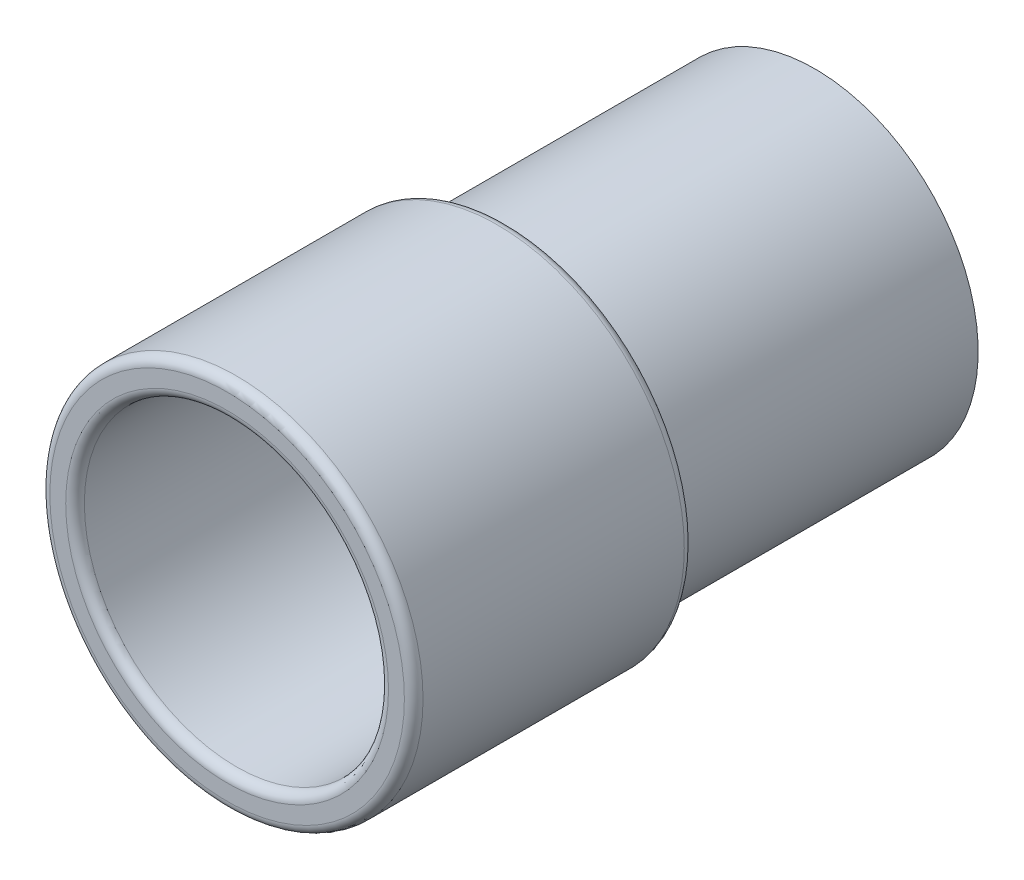
ISO-10303-21;
HEADER;
FILE_DESCRIPTION(('STEP AP214'),'2;1');
FILE_NAME('part.step','',(''),(''),'','','');
FILE_SCHEMA(('AUTOMOTIVE_DESIGN { 1 0 10303 214 1 1 1 1 }'));
ENDSEC;
DATA;
#1=APPLICATION_CONTEXT('core data for automotive mechanical design processes');
#2=APPLICATION_PROTOCOL_DEFINITION('international standard','automotive_design',2000,#1);
#3=PRODUCT_CONTEXT('',#1,'mechanical');
#4=PRODUCT('Part','Part','',(#3));
#5=PRODUCT_RELATED_PRODUCT_CATEGORY('part','',(#4));
#6=PRODUCT_DEFINITION_FORMATION('','',#4);
#7=PRODUCT_DEFINITION_CONTEXT('part definition',#1,'design');
#8=PRODUCT_DEFINITION('design','',#6,#7);
#9=PRODUCT_DEFINITION_SHAPE('','',#8);
#10=(LENGTH_UNIT() NAMED_UNIT(*) SI_UNIT(.MILLI.,.METRE.));
#11=(NAMED_UNIT(*) PLANE_ANGLE_UNIT() SI_UNIT($,.RADIAN.));
#12=(NAMED_UNIT(*) SI_UNIT($,.STERADIAN.) SOLID_ANGLE_UNIT());
#13=UNCERTAINTY_MEASURE_WITH_UNIT(LENGTH_MEASURE(1.E-05),#10,'distance_accuracy_value','');
#14=(GEOMETRIC_REPRESENTATION_CONTEXT(3) GLOBAL_UNCERTAINTY_ASSIGNED_CONTEXT((#13)) GLOBAL_UNIT_ASSIGNED_CONTEXT((#10,
#11,#12)) REPRESENTATION_CONTEXT('',''));
#15=CARTESIAN_POINT('',(0.,0.,0.));
#16=DIRECTION('',(0.,0.,1.));
#17=DIRECTION('',(1.,0.,0.));
#18=AXIS2_PLACEMENT_3D('',#15,#16,#17);
#19=CARTESIAN_POINT('',(0.,0.,0.));
#20=DIRECTION('',(0.,0.,-1.));
#21=DIRECTION('',(-1.,0.,0.));
#22=AXIS2_PLACEMENT_3D('',#19,#20,#21);
#23=PLANE('',#22);
#24=CARTESIAN_POINT('',(0.,0.,0.));
#25=DIRECTION('',(0.,0.,-1.));
#26=DIRECTION('',(-1.,0.,0.));
#27=AXIS2_PLACEMENT_3D('',#24,#25,#26);
#28=CIRCLE('',#27,14.);
#29=CARTESIAN_POINT('',(-14.,0.,0.));
#30=VERTEX_POINT('',#29);
#31=EDGE_CURVE('E298',#30,#30,#28,.F.);
#32=ORIENTED_EDGE('',*,*,#31,.T.);
#33=EDGE_LOOP('',(#32));
#34=FACE_BOUND('',#33,.T.);
#35=CARTESIAN_POINT('',(0.,0.,0.));
#36=DIRECTION('',(0.,0.,-1.));
#37=DIRECTION('',(-1.,0.,0.));
#38=AXIS2_PLACEMENT_3D('',#35,#36,#37);
#39=CIRCLE('',#38,3.5);
#40=CARTESIAN_POINT('',(-3.5,0.,0.));
#41=VERTEX_POINT('',#40);
#42=EDGE_CURVE('E654',#41,#41,#39,.T.);
#43=ORIENTED_EDGE('',*,*,#42,.T.);
#44=EDGE_LOOP('',(#43));
#45=FACE_BOUND('',#44,.T.);
#46=DIRECTION('',(-0.487280608017738,-0.873245446051603,0.));
#47=VECTOR('',#46,1.);
#48=CARTESIAN_POINT('',(2.32712401680226,-1.29856091545318,0.));
#49=LINE('',#48,#47);
#50=CARTESIAN_POINT('',(-1.57112084733964,-8.284524483866,0.));
#51=VERTEX_POINT('',#50);
#52=CARTESIAN_POINT('',(-2.6971996148729,-10.3025468296434,0.));
#53=VERTEX_POINT('',#52);
#54=EDGE_CURVE('E205',#51,#53,#49,.T.);
#55=ORIENTED_EDGE('',*,*,#54,.T.);
#56=CARTESIAN_POINT('',(-3.1338223378987,-10.0589065256346,0.));
#57=DIRECTION('',(0.,0.,-1.));
#58=DIRECTION('',(-1.,0.,0.));
#59=AXIS2_PLACEMENT_3D('',#56,#57,#58);
#60=CIRCLE('',#59,0.5);
#61=CARTESIAN_POINT('',(-3.37746264190757,-10.4955292486604,0.));
#62=VERTEX_POINT('',#61);
#63=EDGE_CURVE('E267',#53,#62,#60,.T.);
#64=ORIENTED_EDGE('',*,*,#63,.T.);
#65=DIRECTION('',(-0.873245446051604,0.487280608017737,0.));
#66=VECTOR('',#65,1.);
#67=CARTESIAN_POINT('',(-5.26796393568401,-9.44060863721608,0.));
#68=LINE('',#67,#66);
#69=CARTESIAN_POINT('',(-7.15846522946052,-8.38568802577175,0.));
#70=VERTEX_POINT('',#69);
#71=EDGE_CURVE('E208',#62,#70,#68,.T.);
#72=ORIENTED_EDGE('',*,*,#71,.T.);
#73=CARTESIAN_POINT('',(-6.91482492545165,-7.94906530274595,0.));
#74=DIRECTION('',(0.,0.,-1.));
#75=DIRECTION('',(-1.,0.,0.));
#76=AXIS2_PLACEMENT_3D('',#73,#74,#75);
#77=CIRCLE('',#76,0.5);
#78=CARTESIAN_POINT('',(-7.35144764847745,-7.70542499873708,0.));
#79=VERTEX_POINT('',#78);
#80=EDGE_CURVE('E259',#70,#79,#77,.T.);
#81=ORIENTED_EDGE('',*,*,#80,.T.);
#82=DIRECTION('',(0.487280608017738,0.873245446051603,0.));
#83=VECTOR('',#82,1.);
#84=CARTESIAN_POINT('',(-2.3271240168023,1.29856091545319,0.));
#85=LINE('',#84,#83);
#86=CARTESIAN_POINT('',(-6.2253688809442,-5.68740265295964,0.));
#87=VERTEX_POINT('',#86);
#88=EDGE_CURVE('E211',#79,#87,#85,.T.);
#89=ORIENTED_EDGE('',*,*,#88,.T.);
#90=CARTESIAN_POINT('',(-5.7887461579184,-5.93104295696851,0.));
#91=DIRECTION('',(0.,0.,-1.));
#92=DIRECTION('',(-1.,0.,0.));
#93=AXIS2_PLACEMENT_3D('',#90,#91,#92);
#94=CIRCLE('',#93,0.5);
#95=CARTESIAN_POINT('',(-5.54510585390953,-5.4944202339427,0.));
#96=VERTEX_POINT('',#95);
#97=EDGE_CURVE('E263',#87,#96,#94,.T.);
#98=ORIENTED_EDGE('',*,*,#97,.T.);
#99=DIRECTION('',(0.873245446051604,-0.487280608017737,0.));
#100=VECTOR('',#99,1.);
#101=CARTESIAN_POINT('',(-3.65460456013303,-6.54934084538703,0.));
#102=LINE('',#101,#100);
#103=CARTESIAN_POINT('',(-1.76410326635658,-7.60426145683133,0.));
#104=VERTEX_POINT('',#103);
#105=EDGE_CURVE('E202',#96,#104,#102,.T.);
#106=ORIENTED_EDGE('',*,*,#105,.T.);
#107=CARTESIAN_POINT('',(-2.00774357036545,-8.04088417985713,0.));
#108=DIRECTION('',(0.,0.,-1.));
#109=DIRECTION('',(-1.,0.,0.));
#110=AXIS2_PLACEMENT_3D('',#107,#108,#109);
#111=CIRCLE('',#110,0.5);
#112=EDGE_CURVE('E271',#104,#51,#111,.T.);
#113=ORIENTED_EDGE('',*,*,#112,.T.);
#114=EDGE_LOOP('',(#55,#64,#72,#81,#89,#98,#106,#113));
#115=FACE_BOUND('',#114,.T.);
#116=DIRECTION('',(-0.48728060801761,-0.873245446051675,0.));
#117=VECTOR('',#116,1.);
#118=CARTESIAN_POINT('',(-2.32712401680149,1.2985609154523,0.));
#119=LINE('',#118,#117);
#120=CARTESIAN_POINT('',(2.6971996148725,10.3025468296436,0.));
#121=VERTEX_POINT('',#120);
#122=CARTESIAN_POINT('',(1.56867938704217,8.28014919363008,0.));
#123=VERTEX_POINT('',#122);
#124=EDGE_CURVE('E199',#121,#123,#119,.T.);
#125=ORIENTED_EDGE('',*,*,#124,.F.);
#126=CARTESIAN_POINT('',(3.13382233789834,10.0589065256348,0.));
#127=DIRECTION('',(0.,0.,-1.));
#128=DIRECTION('',(-1.,0.,0.));
#129=AXIS2_PLACEMENT_3D('',#126,#127,#128);
#130=CIRCLE('',#129,0.5);
#131=CARTESIAN_POINT('',(3.37746264190721,10.4955292486606,0.));
#132=VERTEX_POINT('',#131);
#133=EDGE_CURVE('E278',#121,#132,#130,.T.);
#134=ORIENTED_EDGE('',*,*,#133,.T.);
#135=DIRECTION('',(-0.873245446051604,0.487280608017737,0.));
#136=VECTOR('',#135,1.);
#137=CARTESIAN_POINT('',(5.26796393568402,9.44060863721608,0.));
#138=LINE('',#137,#136);
#139=CARTESIAN_POINT('',(7.15846522946053,8.38568802577174,0.));
#140=VERTEX_POINT('',#139);
#141=EDGE_CURVE('E189',#140,#132,#138,.T.);
#142=ORIENTED_EDGE('',*,*,#141,.F.);
#143=CARTESIAN_POINT('',(6.91482492545166,7.94906530274594,0.));
#144=DIRECTION('',(0.,0.,-1.));
#145=DIRECTION('',(-1.,0.,0.));
#146=AXIS2_PLACEMENT_3D('',#143,#144,#145);
#147=CIRCLE('',#146,0.5);
#148=CARTESIAN_POINT('',(7.35144764847746,7.70542499873707,0.));
#149=VERTEX_POINT('',#148);
#150=EDGE_CURVE('E284',#140,#149,#147,.T.);
#151=ORIENTED_EDGE('',*,*,#150,.T.);
#152=DIRECTION('',(0.487280608017739,0.873245446051603,0.));
#153=VECTOR('',#152,1.);
#154=CARTESIAN_POINT('',(2.3271240168023,-1.2985609154532,0.));
#155=LINE('',#154,#153);
#156=CARTESIAN_POINT('',(6.22536888094421,5.68740265295963,0.));
#157=VERTEX_POINT('',#156);
#158=EDGE_CURVE('E192',#157,#149,#155,.T.);
#159=ORIENTED_EDGE('',*,*,#158,.F.);
#160=CARTESIAN_POINT('',(5.7887461579184,5.9310429569685,0.));
#161=DIRECTION('',(0.,0.,-1.));
#162=DIRECTION('',(-1.,0.,0.));
#163=AXIS2_PLACEMENT_3D('',#160,#161,#162);
#164=CIRCLE('',#163,0.5);
#165=CARTESIAN_POINT('',(5.54510585390953,5.4944202339427,0.));
#166=VERTEX_POINT('',#165);
#167=EDGE_CURVE('E281',#157,#166,#164,.T.);
#168=ORIENTED_EDGE('',*,*,#167,.T.);
#169=DIRECTION('',(0.873245446051603,-0.487280608017738,0.));
#170=VECTOR('',#169,1.);
#171=CARTESIAN_POINT('',(3.65460456013303,6.54934084538703,0.));
#172=LINE('',#171,#170);
#173=CARTESIAN_POINT('',(3.65460456013308,6.549340845387,0.));
#174=VERTEX_POINT('',#173);
#175=EDGE_CURVE('E196',#174,#166,#172,.T.);
#176=ORIENTED_EDGE('',*,*,#175,.F.);
#177=DIRECTION('',(-0.874371144773339,0.485257767776839,0.));
#178=VECTOR('',#177,1.);
#179=CARTESIAN_POINT('',(3.63942350631884,6.55776601395578,0.));
#180=LINE('',#179,#178);
#181=CARTESIAN_POINT('',(1.76267322617958,7.5993233172346,0.));
#182=VERTEX_POINT('',#181);
#183=EDGE_CURVE('E170',#174,#182,#180,.T.);
#184=ORIENTED_EDGE('',*,*,#183,.T.);
#185=CARTESIAN_POINT('',(2.005302110068,8.03650888962127,0.));
#186=DIRECTION('',(0.,0.,-1.));
#187=DIRECTION('',(-1.,0.,0.));
#188=AXIS2_PLACEMENT_3D('',#185,#186,#187);
#189=CIRCLE('',#188,0.5);
#190=EDGE_CURVE('E274',#182,#123,#189,.T.);
#191=ORIENTED_EDGE('',*,*,#190,.T.);
#192=EDGE_LOOP('',(#125,#134,#142,#151,#159,#168,#176,#184,#191));
#193=FACE_BOUND('',#192,.T.);
#194=ADVANCED_FACE('F42',(#34,#45,#115,#193),#23,.F.);
#195=CARTESIAN_POINT('',(0.,0.,-3.));
#196=DIRECTION('',(0.,0.,-1.));
#197=DIRECTION('',(-1.,0.,0.));
#198=AXIS2_PLACEMENT_3D('',#195,#196,#197);
#199=PLANE('',#198);
#200=CARTESIAN_POINT('',(0.,0.,-3.));
#201=DIRECTION('',(0.,0.,-1.));
#202=DIRECTION('',(-1.,0.,0.));
#203=AXIS2_PLACEMENT_3D('',#200,#201,#202);
#204=CIRCLE('',#203,3.5);
#205=CARTESIAN_POINT('',(-3.5,0.,-3.));
#206=VERTEX_POINT('',#205);
#207=EDGE_CURVE('E651',#206,#206,#204,.T.);
#208=ORIENTED_EDGE('',*,*,#207,.F.);
#209=EDGE_LOOP('',(#208));
#210=FACE_BOUND('',#209,.T.);
#211=DIRECTION('',(0.487280608017738,0.873245446051603,0.));
#212=VECTOR('',#211,1.);
#213=CARTESIAN_POINT('',(-2.3271240168023,1.29856091545319,-3.));
#214=LINE('',#213,#212);
#215=CARTESIAN_POINT('',(-7.35144764847745,-7.70542499873708,-3.));
#216=VERTEX_POINT('',#215);
#217=CARTESIAN_POINT('',(-6.2253688809442,-5.68740265295964,-3.));
#218=VERTEX_POINT('',#217);
#219=EDGE_CURVE('E174',#216,#218,#214,.T.);
#220=ORIENTED_EDGE('',*,*,#219,.F.);
#221=CARTESIAN_POINT('',(-6.91482492545165,-7.94906530274595,-3.));
#222=DIRECTION('',(0.,0.,-1.));
#223=DIRECTION('',(-1.,0.,0.));
#224=AXIS2_PLACEMENT_3D('',#221,#222,#223);
#225=CIRCLE('',#224,0.5);
#226=CARTESIAN_POINT('',(-7.15846522946052,-8.38568802577176,-3.));
#227=VERTEX_POINT('',#226);
#228=EDGE_CURVE('E257',#216,#227,#225,.F.);
#229=ORIENTED_EDGE('',*,*,#228,.T.);
#230=DIRECTION('',(-0.873245446051604,0.487280608017737,0.));
#231=VECTOR('',#230,1.);
#232=CARTESIAN_POINT('',(-5.26796393568401,-9.44060863721609,-3.));
#233=LINE('',#232,#231);
#234=CARTESIAN_POINT('',(-3.37746264190757,-10.4955292486604,-3.));
#235=VERTEX_POINT('',#234);
#236=EDGE_CURVE('E193',#235,#227,#233,.T.);
#237=ORIENTED_EDGE('',*,*,#236,.F.);
#238=CARTESIAN_POINT('',(-3.1338223378987,-10.0589065256346,-3.));
#239=DIRECTION('',(0.,0.,-1.));
#240=DIRECTION('',(-1.,0.,0.));
#241=AXIS2_PLACEMENT_3D('',#238,#239,#240);
#242=CIRCLE('',#241,0.5);
#243=CARTESIAN_POINT('',(-2.6971996148729,-10.3025468296434,-3.));
#244=VERTEX_POINT('',#243);
#245=EDGE_CURVE('E265',#235,#244,#242,.F.);
#246=ORIENTED_EDGE('',*,*,#245,.T.);
#247=DIRECTION('',(-0.487280608017738,-0.873245446051603,0.));
#248=VECTOR('',#247,1.);
#249=CARTESIAN_POINT('',(2.32712401680226,-1.29856091545317,-3.));
#250=LINE('',#249,#248);
#251=CARTESIAN_POINT('',(-1.57112084733964,-8.284524483866,-3.));
#252=VERTEX_POINT('',#251);
#253=EDGE_CURVE('E666',#252,#244,#250,.T.);
#254=ORIENTED_EDGE('',*,*,#253,.F.);
#255=CARTESIAN_POINT('',(-2.00774357036545,-8.04088417985713,-3.));
#256=DIRECTION('',(0.,0.,-1.));
#257=DIRECTION('',(-1.,0.,0.));
#258=AXIS2_PLACEMENT_3D('',#255,#256,#257);
#259=CIRCLE('',#258,0.5);
#260=CARTESIAN_POINT('',(-1.76410326635658,-7.60426145683133,-3.));
#261=VERTEX_POINT('',#260);
#262=EDGE_CURVE('E269',#252,#261,#259,.F.);
#263=ORIENTED_EDGE('',*,*,#262,.T.);
#264=DIRECTION('',(0.873245446051604,-0.487280608017737,0.));
#265=VECTOR('',#264,1.);
#266=CARTESIAN_POINT('',(-3.65460456013303,-6.54934084538703,-3.));
#267=LINE('',#266,#265);
#268=CARTESIAN_POINT('',(-5.54510585390953,-5.4944202339427,-3.));
#269=VERTEX_POINT('',#268);
#270=EDGE_CURVE('E663',#269,#261,#267,.T.);
#271=ORIENTED_EDGE('',*,*,#270,.F.);
#272=CARTESIAN_POINT('',(-5.7887461579184,-5.93104295696851,-3.));
#273=DIRECTION('',(0.,0.,-1.));
#274=DIRECTION('',(-1.,0.,0.));
#275=AXIS2_PLACEMENT_3D('',#272,#273,#274);
#276=CIRCLE('',#275,0.5);
#277=EDGE_CURVE('E261',#269,#218,#276,.F.);
#278=ORIENTED_EDGE('',*,*,#277,.T.);
#279=EDGE_LOOP('',(#220,#229,#237,#246,#254,#263,#271,#278));
#280=FACE_BOUND('',#279,.T.);
#281=CARTESIAN_POINT('',(0.,0.,-3.));
#282=DIRECTION('',(0.,0.,-1.));
#283=DIRECTION('',(-1.,0.,0.));
#284=AXIS2_PLACEMENT_3D('',#281,#282,#283);
#285=CIRCLE('',#284,17.5);
#286=CARTESIAN_POINT('',(-17.5,0.,-3.));
#287=VERTEX_POINT('',#286);
#288=EDGE_CURVE('E214',#287,#287,#285,.T.);
#289=ORIENTED_EDGE('',*,*,#288,.T.);
#290=EDGE_LOOP('',(#289));
#291=FACE_BOUND('',#290,.T.);
#292=DIRECTION('',(0.487280608017739,0.873245446051603,0.));
#293=VECTOR('',#292,1.);
#294=CARTESIAN_POINT('',(2.3271240168023,-1.2985609154532,-3.));
#295=LINE('',#294,#293);
#296=CARTESIAN_POINT('',(6.22536888094421,5.68740265295963,-3.));
#297=VERTEX_POINT('',#296);
#298=CARTESIAN_POINT('',(7.35144764847746,7.70542499873707,-3.));
#299=VERTEX_POINT('',#298);
#300=EDGE_CURVE('E181',#297,#299,#295,.T.);
#301=ORIENTED_EDGE('',*,*,#300,.T.);
#302=CARTESIAN_POINT('',(6.91482492545166,7.94906530274594,-3.));
#303=DIRECTION('',(0.,0.,-1.));
#304=DIRECTION('',(-1.,0.,0.));
#305=AXIS2_PLACEMENT_3D('',#302,#303,#304);
#306=CIRCLE('',#305,0.5);
#307=CARTESIAN_POINT('',(7.15846522946053,8.38568802577174,-3.));
#308=VERTEX_POINT('',#307);
#309=EDGE_CURVE('E57',#299,#308,#306,.F.);
#310=ORIENTED_EDGE('',*,*,#309,.T.);
#311=DIRECTION('',(-0.873245446051604,0.487280608017737,0.));
#312=VECTOR('',#311,1.);
#313=CARTESIAN_POINT('',(5.26796393568402,9.44060863721608,-3.));
#314=LINE('',#313,#312);
#315=CARTESIAN_POINT('',(3.37746264190721,10.4955292486606,-3.));
#316=VERTEX_POINT('',#315);
#317=EDGE_CURVE('E657',#308,#316,#314,.T.);
#318=ORIENTED_EDGE('',*,*,#317,.T.);
#319=CARTESIAN_POINT('',(3.13382233789834,10.0589065256348,-3.));
#320=DIRECTION('',(0.,0.,-1.));
#321=DIRECTION('',(-1.,0.,0.));
#322=AXIS2_PLACEMENT_3D('',#319,#320,#321);
#323=CIRCLE('',#322,0.5);
#324=CARTESIAN_POINT('',(2.6971996148725,10.3025468296436,-3.));
#325=VERTEX_POINT('',#324);
#326=EDGE_CURVE('E276',#316,#325,#323,.F.);
#327=ORIENTED_EDGE('',*,*,#326,.T.);
#328=DIRECTION('',(-0.48728060801761,-0.873245446051675,0.));
#329=VECTOR('',#328,1.);
#330=CARTESIAN_POINT('',(-2.32712401680149,1.2985609154523,-3.));
#331=LINE('',#330,#329);
#332=CARTESIAN_POINT('',(1.56867938704217,8.28014919363008,-3.));
#333=VERTEX_POINT('',#332);
#334=EDGE_CURVE('E655',#325,#333,#331,.T.);
#335=ORIENTED_EDGE('',*,*,#334,.T.);
#336=CARTESIAN_POINT('',(2.005302110068,8.03650888962127,-3.));
#337=DIRECTION('',(0.,0.,-1.));
#338=DIRECTION('',(-1.,0.,0.));
#339=AXIS2_PLACEMENT_3D('',#336,#337,#338);
#340=CIRCLE('',#339,0.5);
#341=CARTESIAN_POINT('',(1.76267322617958,7.5993233172346,-3.));
#342=VERTEX_POINT('',#341);
#343=EDGE_CURVE('E185',#333,#342,#340,.F.);
#344=ORIENTED_EDGE('',*,*,#343,.T.);
#345=DIRECTION('',(-0.874371144773339,0.485257767776839,0.));
#346=VECTOR('',#345,1.);
#347=CARTESIAN_POINT('',(3.63942350631884,6.55776601395578,-3.));
#348=LINE('',#347,#346);
#349=CARTESIAN_POINT('',(3.65460456013308,6.549340845387,-3.));
#350=VERTEX_POINT('',#349);
#351=EDGE_CURVE('E167',#350,#342,#348,.T.);
#352=ORIENTED_EDGE('',*,*,#351,.F.);
#353=DIRECTION('',(0.873245446051603,-0.487280608017738,0.));
#354=VECTOR('',#353,1.);
#355=CARTESIAN_POINT('',(3.65460456013303,6.54934084538702,-3.));
#356=LINE('',#355,#354);
#357=CARTESIAN_POINT('',(5.54510585390953,5.4944202339427,-3.));
#358=VERTEX_POINT('',#357);
#359=EDGE_CURVE('E177',#350,#358,#356,.T.);
#360=ORIENTED_EDGE('',*,*,#359,.T.);
#361=CARTESIAN_POINT('',(5.7887461579184,5.9310429569685,-3.));
#362=DIRECTION('',(0.,0.,-1.));
#363=DIRECTION('',(-1.,0.,0.));
#364=AXIS2_PLACEMENT_3D('',#361,#362,#363);
#365=CIRCLE('',#364,0.5);
#366=EDGE_CURVE('E65',#358,#297,#365,.F.);
#367=ORIENTED_EDGE('',*,*,#366,.T.);
#368=EDGE_LOOP('',(#301,#310,#318,#327,#335,#344,#352,#360,#367));
#369=FACE_BOUND('',#368,.T.);
#370=ADVANCED_FACE('F183',(#210,#280,#291,#369),#199,.T.);
#371=CARTESIAN_POINT('',(0.,0.,30.));
#372=DIRECTION('',(0.,0.,-1.));
#373=DIRECTION('',(-1.,0.,0.));
#374=AXIS2_PLACEMENT_3D('',#371,#372,#373);
#375=CYLINDRICAL_SURFACE('',#374,17.5);
#376=CARTESIAN_POINT('',(0.,0.,30.));
#377=DIRECTION('',(0.,0.,1.));
#378=DIRECTION('',(1.,0.,0.));
#379=AXIS2_PLACEMENT_3D('',#376,#377,#378);
#380=CIRCLE('',#379,17.5);
#381=CARTESIAN_POINT('',(17.5,0.,30.));
#382=VERTEX_POINT('',#381);
#383=EDGE_CURVE('E217',#382,#382,#380,.T.);
#384=ORIENTED_EDGE('',*,*,#383,.F.);
#385=EDGE_LOOP('',(#384));
#386=FACE_BOUND('',#385,.T.);
#387=ORIENTED_EDGE('',*,*,#288,.F.);
#388=EDGE_LOOP('',(#387));
#389=FACE_BOUND('',#388,.T.);
#390=ADVANCED_FACE('F333',(#386,#389),#375,.T.);
#391=CARTESIAN_POINT('',(0.,0.,30.));
#392=DIRECTION('',(0.,0.,-1.));
#393=DIRECTION('',(-1.,0.,0.));
#394=AXIS2_PLACEMENT_3D('',#391,#392,#393);
#395=CYLINDRICAL_SURFACE('',#394,15.);
#396=CARTESIAN_POINT('',(0.,0.,29.5133931252681));
#397=DIRECTION('',(0.,0.,-1.));
#398=DIRECTION('',(-1.,0.,0.));
#399=AXIS2_PLACEMENT_3D('',#396,#397,#398);
#400=CIRCLE('',#399,15.);
#401=CARTESIAN_POINT('',(-15.,0.,29.5133931252681));
#402=VERTEX_POINT('',#401);
#403=EDGE_CURVE('E50',#402,#402,#400,.F.);
#404=ORIENTED_EDGE('',*,*,#403,.T.);
#405=EDGE_LOOP('',(#404));
#406=FACE_BOUND('',#405,.T.);
#407=CARTESIAN_POINT('',(0.,0.,1.));
#408=DIRECTION('',(0.,0.,-1.));
#409=DIRECTION('',(-1.,0.,0.));
#410=AXIS2_PLACEMENT_3D('',#407,#408,#409);
#411=CIRCLE('',#410,15.);
#412=CARTESIAN_POINT('',(-15.,0.,1.));
#413=VERTEX_POINT('',#412);
#414=EDGE_CURVE('E301',#413,#413,#411,.T.);
#415=ORIENTED_EDGE('',*,*,#414,.T.);
#416=EDGE_LOOP('',(#415));
#417=FACE_BOUND('',#416,.T.);
#418=ADVANCED_FACE('F315',(#406,#417),#395,.F.);
#419=CARTESIAN_POINT('',(0.,0.,30.));
#420=DIRECTION('',(0.,0.,1.));
#421=DIRECTION('',(1.,0.,0.));
#422=AXIS2_PLACEMENT_3D('',#419,#420,#421);
#423=PLANE('',#422);
#424=CARTESIAN_POINT('',(0.,0.,30.));
#425=DIRECTION('',(0.,0.,1.));
#426=DIRECTION('',(1.,0.,0.));
#427=AXIS2_PLACEMENT_3D('',#424,#425,#426);
#428=CIRCLE('',#427,19.);
#429=CARTESIAN_POINT('',(19.,0.,30.));
#430=VERTEX_POINT('',#429);
#431=EDGE_CURVE('E292',#430,#430,#428,.F.);
#432=ORIENTED_EDGE('',*,*,#431,.T.);
#433=EDGE_LOOP('',(#432));
#434=FACE_BOUND('',#433,.T.);
#435=ORIENTED_EDGE('',*,*,#383,.T.);
#436=EDGE_LOOP('',(#435));
#437=FACE_BOUND('',#436,.T.);
#438=ADVANCED_FACE('F348',(#434,#437),#423,.F.);
#439=CARTESIAN_POINT('',(0.,0.,60.));
#440=DIRECTION('',(0.,0.,1.));
#441=DIRECTION('',(1.,0.,0.));
#442=AXIS2_PLACEMENT_3D('',#439,#440,#441);
#443=PLANE('',#442);
#444=CARTESIAN_POINT('',(0.,0.,60.));
#445=DIRECTION('',(0.,0.,1.));
#446=DIRECTION('',(1.,0.,0.));
#447=AXIS2_PLACEMENT_3D('',#444,#445,#446);
#448=CIRCLE('',#447,17.3);
#449=CARTESIAN_POINT('',(17.3,0.,60.));
#450=VERTEX_POINT('',#449);
#451=EDGE_CURVE('E310',#450,#450,#448,.F.);
#452=ORIENTED_EDGE('',*,*,#451,.T.);
#453=EDGE_LOOP('',(#452));
#454=FACE_BOUND('',#453,.T.);
#455=CARTESIAN_POINT('',(0.,0.,60.));
#456=DIRECTION('',(0.,0.,1.));
#457=DIRECTION('',(1.,0.,0.));
#458=AXIS2_PLACEMENT_3D('',#455,#456,#457);
#459=CIRCLE('',#458,19.);
#460=CARTESIAN_POINT('',(19.,0.,60.));
#461=VERTEX_POINT('',#460);
#462=EDGE_CURVE('E295',#461,#461,#459,.T.);
#463=ORIENTED_EDGE('',*,*,#462,.T.);
#464=EDGE_LOOP('',(#463));
#465=FACE_BOUND('',#464,.T.);
#466=ADVANCED_FACE('F345',(#454,#465),#443,.T.);
#467=CARTESIAN_POINT('',(0.,0.,60.));
#468=DIRECTION('',(0.,0.,-1.));
#469=DIRECTION('',(-1.,0.,0.));
#470=AXIS2_PLACEMENT_3D('',#467,#468,#469);
#471=CYLINDRICAL_SURFACE('',#470,20.);
#472=CARTESIAN_POINT('',(0.,0.,31.));
#473=DIRECTION('',(0.,0.,1.));
#474=DIRECTION('',(1.,0.,0.));
#475=AXIS2_PLACEMENT_3D('',#472,#473,#474);
#476=CIRCLE('',#475,20.);
#477=CARTESIAN_POINT('',(20.,0.,31.));
#478=VERTEX_POINT('',#477);
#479=EDGE_CURVE('E289',#478,#478,#476,.T.);
#480=ORIENTED_EDGE('',*,*,#479,.T.);
#481=EDGE_LOOP('',(#480));
#482=FACE_BOUND('',#481,.T.);
#483=CARTESIAN_POINT('',(0.,0.,59.));
#484=DIRECTION('',(0.,0.,1.));
#485=DIRECTION('',(1.,0.,0.));
#486=AXIS2_PLACEMENT_3D('',#483,#484,#485);
#487=CIRCLE('',#486,20.);
#488=CARTESIAN_POINT('',(20.,0.,59.));
#489=VERTEX_POINT('',#488);
#490=EDGE_CURVE('E286',#489,#489,#487,.F.);
#491=ORIENTED_EDGE('',*,*,#490,.T.);
#492=EDGE_LOOP('',(#491));
#493=FACE_BOUND('',#492,.T.);
#494=ADVANCED_FACE('F343',(#482,#493),#471,.T.);
#495=CARTESIAN_POINT('',(0.,0.,60.));
#496=DIRECTION('',(0.,0.,-1.));
#497=DIRECTION('',(-1.,0.,0.));
#498=AXIS2_PLACEMENT_3D('',#495,#496,#497);
#499=CYLINDRICAL_SURFACE('',#498,16.3);
#500=CARTESIAN_POINT('',(0.,0.,59.));
#501=DIRECTION('',(0.,0.,1.));
#502=DIRECTION('',(1.,0.,0.));
#503=AXIS2_PLACEMENT_3D('',#500,#501,#502);
#504=CIRCLE('',#503,16.3);
#505=CARTESIAN_POINT('',(16.3,0.,59.));
#506=VERTEX_POINT('',#505);
#507=EDGE_CURVE('E307',#506,#506,#504,.T.);
#508=ORIENTED_EDGE('',*,*,#507,.T.);
#509=EDGE_LOOP('',(#508));
#510=FACE_BOUND('',#509,.T.);
#511=CARTESIAN_POINT('',(0.,0.,31.));
#512=DIRECTION('',(0.,0.,1.));
#513=DIRECTION('',(1.,0.,0.));
#514=AXIS2_PLACEMENT_3D('',#511,#512,#513);
#515=CIRCLE('',#514,16.3);
#516=CARTESIAN_POINT('',(16.3,0.,31.));
#517=VERTEX_POINT('',#516);
#518=EDGE_CURVE('E304',#517,#517,#515,.F.);
#519=ORIENTED_EDGE('',*,*,#518,.T.);
#520=EDGE_LOOP('',(#519));
#521=FACE_BOUND('',#520,.T.);
#522=ADVANCED_FACE('F339',(#510,#521),#499,.F.);
#523=CARTESIAN_POINT('',(-2.32712401680149,1.2985609154523,60.));
#524=DIRECTION('',(0.873245446051675,-0.48728060801761,0.));
#525=DIRECTION('',(0.48728060801761,0.873245446051675,0.));
#526=AXIS2_PLACEMENT_3D('',#523,#524,#525);
#527=PLANE('',#526);
#528=ORIENTED_EDGE('',*,*,#124,.T.);
#529=DIRECTION('',(0.,0.,-1.));
#530=VECTOR('',#529,1.);
#531=CARTESIAN_POINT('',(1.56867938704217,8.28014919363008,60.));
#532=LINE('',#531,#530);
#533=EDGE_CURVE('E242',#123,#333,#532,.T.);
#534=ORIENTED_EDGE('',*,*,#533,.T.);
#535=ORIENTED_EDGE('',*,*,#334,.F.);
#536=DIRECTION('',(0.,0.,-1.));
#537=VECTOR('',#536,1.);
#538=CARTESIAN_POINT('',(2.6971996148725,10.3025468296436,0.));
#539=LINE('',#538,#537);
#540=EDGE_CURVE('E240',#325,#121,#539,.F.);
#541=ORIENTED_EDGE('',*,*,#540,.T.);
#542=EDGE_LOOP('',(#528,#534,#535,#541));
#543=FACE_BOUND('',#542,.T.);
#544=ADVANCED_FACE('F342',(#543),#527,.T.);
#545=CARTESIAN_POINT('',(3.63942350631884,6.55776601395578,60.));
#546=DIRECTION('',(-0.485257767776839,-0.874371144773339,0.));
#547=DIRECTION('',(0.874371144773339,-0.485257767776839,0.));
#548=AXIS2_PLACEMENT_3D('',#545,#546,#547);
#549=PLANE('',#548);
#550=ORIENTED_EDGE('',*,*,#351,.T.);
#551=DIRECTION('',(0.,0.,-1.));
#552=VECTOR('',#551,1.);
#553=CARTESIAN_POINT('',(1.76267322617958,7.5993233172346,60.));
#554=LINE('',#553,#552);
#555=EDGE_CURVE('E245',#342,#182,#554,.F.);
#556=ORIENTED_EDGE('',*,*,#555,.T.);
#557=ORIENTED_EDGE('',*,*,#183,.F.);
#558=DIRECTION('',(0.,0.,-1.));
#559=VECTOR('',#558,1.);
#560=CARTESIAN_POINT('',(3.65460456013308,6.549340845387,60.));
#561=LINE('',#560,#559);
#562=EDGE_CURVE('E163',#174,#350,#561,.T.);
#563=ORIENTED_EDGE('',*,*,#562,.T.);
#564=EDGE_LOOP('',(#550,#556,#557,#563));
#565=FACE_BOUND('',#564,.T.);
#566=ADVANCED_FACE('F165',(#565),#549,.F.);
#567=CARTESIAN_POINT('',(3.65460456013303,6.54934084538702,60.));
#568=DIRECTION('',(0.487280608017738,0.873245446051603,0.));
#569=DIRECTION('',(-0.873245446051603,0.487280608017738,0.));
#570=AXIS2_PLACEMENT_3D('',#567,#568,#569);
#571=PLANE('',#570);
#572=ORIENTED_EDGE('',*,*,#175,.T.);
#573=DIRECTION('',(0.,0.,-1.));
#574=VECTOR('',#573,1.);
#575=CARTESIAN_POINT('',(5.54510585390953,5.49442023394269,-3.));
#576=LINE('',#575,#574);
#577=EDGE_CURVE('E180',#166,#358,#576,.T.);
#578=ORIENTED_EDGE('',*,*,#577,.T.);
#579=ORIENTED_EDGE('',*,*,#359,.F.);
#580=ORIENTED_EDGE('',*,*,#562,.F.);
#581=EDGE_LOOP('',(#572,#578,#579,#580));
#582=FACE_BOUND('',#581,.T.);
#583=ADVANCED_FACE('F178',(#582),#571,.T.);
#584=CARTESIAN_POINT('',(2.3271240168023,-1.2985609154532,60.));
#585=DIRECTION('',(-0.873245446051603,0.487280608017739,0.));
#586=DIRECTION('',(-0.487280608017739,-0.873245446051603,0.));
#587=AXIS2_PLACEMENT_3D('',#584,#585,#586);
#588=PLANE('',#587);
#589=ORIENTED_EDGE('',*,*,#300,.F.);
#590=DIRECTION('',(0.,0.,-1.));
#591=VECTOR('',#590,1.);
#592=CARTESIAN_POINT('',(6.22536888094421,5.68740265295963,0.));
#593=LINE('',#592,#591);
#594=EDGE_CURVE('E255',#297,#157,#593,.F.);
#595=ORIENTED_EDGE('',*,*,#594,.T.);
#596=ORIENTED_EDGE('',*,*,#158,.T.);
#597=DIRECTION('',(0.,0.,-1.));
#598=VECTOR('',#597,1.);
#599=CARTESIAN_POINT('',(7.35144764847746,7.70542499873707,-3.));
#600=LINE('',#599,#598);
#601=EDGE_CURVE('E253',#149,#299,#600,.T.);
#602=ORIENTED_EDGE('',*,*,#601,.T.);
#603=EDGE_LOOP('',(#589,#595,#596,#602));
#604=FACE_BOUND('',#603,.T.);
#605=ADVANCED_FACE('F475',(#604),#588,.T.);
#606=CARTESIAN_POINT('',(5.26796393568402,9.44060863721608,60.));
#607=DIRECTION('',(-0.487280608017737,-0.873245446051604,0.));
#608=DIRECTION('',(0.873245446051604,-0.487280608017737,0.));
#609=AXIS2_PLACEMENT_3D('',#606,#607,#608);
#610=PLANE('',#609);
#611=ORIENTED_EDGE('',*,*,#141,.T.);
#612=DIRECTION('',(0.,0.,-1.));
#613=VECTOR('',#612,1.);
#614=CARTESIAN_POINT('',(3.37746264190721,10.4955292486606,-3.));
#615=LINE('',#614,#613);
#616=EDGE_CURVE('E249',#132,#316,#615,.T.);
#617=ORIENTED_EDGE('',*,*,#616,.T.);
#618=ORIENTED_EDGE('',*,*,#317,.F.);
#619=DIRECTION('',(0.,0.,-1.));
#620=VECTOR('',#619,1.);
#621=CARTESIAN_POINT('',(7.15846522946053,8.38568802577174,0.));
#622=LINE('',#621,#620);
#623=EDGE_CURVE('E247',#308,#140,#622,.F.);
#624=ORIENTED_EDGE('',*,*,#623,.T.);
#625=EDGE_LOOP('',(#611,#617,#618,#624));
#626=FACE_BOUND('',#625,.T.);
#627=ADVANCED_FACE('F482',(#626),#610,.T.);
#628=CARTESIAN_POINT('',(-2.3271240168023,1.29856091545319,60.));
#629=DIRECTION('',(-0.873245446051603,0.487280608017738,0.));
#630=DIRECTION('',(-0.487280608017738,-0.873245446051603,0.));
#631=AXIS2_PLACEMENT_3D('',#628,#629,#630);
#632=PLANE('',#631);
#633=ORIENTED_EDGE('',*,*,#88,.F.);
#634=DIRECTION('',(0.,0.,-1.));
#635=VECTOR('',#634,1.);
#636=CARTESIAN_POINT('',(-7.35144764847745,-7.70542499873708,-3.));
#637=LINE('',#636,#635);
#638=EDGE_CURVE('E222',#79,#216,#637,.T.);
#639=ORIENTED_EDGE('',*,*,#638,.T.);
#640=ORIENTED_EDGE('',*,*,#219,.T.);
#641=DIRECTION('',(0.,0.,-1.));
#642=VECTOR('',#641,1.);
#643=CARTESIAN_POINT('',(-6.2253688809442,-5.68740265295964,0.));
#644=LINE('',#643,#642);
#645=EDGE_CURVE('E220',#218,#87,#644,.F.);
#646=ORIENTED_EDGE('',*,*,#645,.T.);
#647=EDGE_LOOP('',(#633,#639,#640,#646));
#648=FACE_BOUND('',#647,.T.);
#649=ADVANCED_FACE('F490',(#648),#632,.F.);
#650=CARTESIAN_POINT('',(-5.26796393568401,-9.44060863721609,60.));
#651=DIRECTION('',(-0.487280608017737,-0.873245446051604,0.));
#652=DIRECTION('',(0.873245446051604,-0.487280608017737,0.));
#653=AXIS2_PLACEMENT_3D('',#650,#651,#652);
#654=PLANE('',#653);
#655=ORIENTED_EDGE('',*,*,#236,.T.);
#656=DIRECTION('',(0.,0.,-1.));
#657=VECTOR('',#656,1.);
#658=CARTESIAN_POINT('',(-7.15846522946052,-8.38568802577176,0.));
#659=LINE('',#658,#657);
#660=EDGE_CURVE('E228',#227,#70,#659,.F.);
#661=ORIENTED_EDGE('',*,*,#660,.T.);
#662=ORIENTED_EDGE('',*,*,#71,.F.);
#663=DIRECTION('',(0.,0.,-1.));
#664=VECTOR('',#663,1.);
#665=CARTESIAN_POINT('',(-3.37746264190757,-10.4955292486604,-3.));
#666=LINE('',#665,#664);
#667=EDGE_CURVE('E225',#62,#235,#666,.T.);
#668=ORIENTED_EDGE('',*,*,#667,.T.);
#669=EDGE_LOOP('',(#655,#661,#662,#668));
#670=FACE_BOUND('',#669,.T.);
#671=ADVANCED_FACE('F498',(#670),#654,.F.);
#672=CARTESIAN_POINT('',(2.32712401680226,-1.29856091545317,60.));
#673=DIRECTION('',(0.873245446051603,-0.487280608017738,0.));
#674=DIRECTION('',(0.487280608017738,0.873245446051603,0.));
#675=AXIS2_PLACEMENT_3D('',#672,#673,#674);
#676=PLANE('',#675);
#677=ORIENTED_EDGE('',*,*,#253,.T.);
#678=DIRECTION('',(0.,0.,-1.));
#679=VECTOR('',#678,1.);
#680=CARTESIAN_POINT('',(-2.6971996148729,-10.3025468296434,0.));
#681=LINE('',#680,#679);
#682=EDGE_CURVE('E238',#244,#53,#681,.F.);
#683=ORIENTED_EDGE('',*,*,#682,.T.);
#684=ORIENTED_EDGE('',*,*,#54,.F.);
#685=DIRECTION('',(0.,0.,-1.));
#686=VECTOR('',#685,1.);
#687=CARTESIAN_POINT('',(-1.57112084733964,-8.284524483866,-3.));
#688=LINE('',#687,#686);
#689=EDGE_CURVE('E235',#51,#252,#688,.T.);
#690=ORIENTED_EDGE('',*,*,#689,.T.);
#691=EDGE_LOOP('',(#677,#683,#684,#690));
#692=FACE_BOUND('',#691,.T.);
#693=ADVANCED_FACE('F506',(#692),#676,.F.);
#694=CARTESIAN_POINT('',(-3.65460456013303,-6.54934084538703,60.));
#695=DIRECTION('',(0.487280608017737,0.873245446051604,0.));
#696=DIRECTION('',(-0.873245446051604,0.487280608017737,0.));
#697=AXIS2_PLACEMENT_3D('',#694,#695,#696);
#698=PLANE('',#697);
#699=ORIENTED_EDGE('',*,*,#105,.F.);
#700=DIRECTION('',(0.,0.,-1.));
#701=VECTOR('',#700,1.);
#702=CARTESIAN_POINT('',(-5.54510585390953,-5.4944202339427,-3.));
#703=LINE('',#702,#701);
#704=EDGE_CURVE('E232',#96,#269,#703,.T.);
#705=ORIENTED_EDGE('',*,*,#704,.T.);
#706=ORIENTED_EDGE('',*,*,#270,.T.);
#707=DIRECTION('',(0.,0.,-1.));
#708=VECTOR('',#707,1.);
#709=CARTESIAN_POINT('',(-1.76410326635658,-7.60426145683133,0.));
#710=LINE('',#709,#708);
#711=EDGE_CURVE('E230',#261,#104,#710,.F.);
#712=ORIENTED_EDGE('',*,*,#711,.T.);
#713=EDGE_LOOP('',(#699,#705,#706,#712));
#714=FACE_BOUND('',#713,.T.);
#715=ADVANCED_FACE('F365',(#714),#698,.F.);
#716=CARTESIAN_POINT('',(-6.91482492545165,-7.94906530274595,60.));
#717=DIRECTION('',(0.,0.,1.));
#718=DIRECTION('',(1.,0.,0.));
#719=AXIS2_PLACEMENT_3D('',#716,#717,#718);
#720=CYLINDRICAL_SURFACE('',#719,0.5);
#721=ORIENTED_EDGE('',*,*,#80,.F.);
#722=ORIENTED_EDGE('',*,*,#660,.F.);
#723=ORIENTED_EDGE('',*,*,#228,.F.);
#724=ORIENTED_EDGE('',*,*,#638,.F.);
#725=EDGE_LOOP('',(#721,#722,#723,#724));
#726=FACE_BOUND('',#725,.T.);
#727=ADVANCED_FACE('F361',(#726),#720,.F.);
#728=CARTESIAN_POINT('',(-5.7887461579184,-5.93104295696851,60.));
#729=DIRECTION('',(0.,0.,1.));
#730=DIRECTION('',(1.,0.,0.));
#731=AXIS2_PLACEMENT_3D('',#728,#729,#730);
#732=CYLINDRICAL_SURFACE('',#731,0.5);
#733=ORIENTED_EDGE('',*,*,#97,.F.);
#734=ORIENTED_EDGE('',*,*,#645,.F.);
#735=ORIENTED_EDGE('',*,*,#277,.F.);
#736=ORIENTED_EDGE('',*,*,#704,.F.);
#737=EDGE_LOOP('',(#733,#734,#735,#736));
#738=FACE_BOUND('',#737,.T.);
#739=ADVANCED_FACE('F364',(#738),#732,.F.);
#740=CARTESIAN_POINT('',(-3.1338223378987,-10.0589065256346,60.));
#741=DIRECTION('',(0.,0.,1.));
#742=DIRECTION('',(1.,0.,0.));
#743=AXIS2_PLACEMENT_3D('',#740,#741,#742);
#744=CYLINDRICAL_SURFACE('',#743,0.5);
#745=ORIENTED_EDGE('',*,*,#63,.F.);
#746=ORIENTED_EDGE('',*,*,#682,.F.);
#747=ORIENTED_EDGE('',*,*,#245,.F.);
#748=ORIENTED_EDGE('',*,*,#667,.F.);
#749=EDGE_LOOP('',(#745,#746,#747,#748));
#750=FACE_BOUND('',#749,.T.);
#751=ADVANCED_FACE('F369',(#750),#744,.F.);
#752=CARTESIAN_POINT('',(-2.00774357036545,-8.04088417985713,60.));
#753=DIRECTION('',(0.,0.,1.));
#754=DIRECTION('',(1.,0.,0.));
#755=AXIS2_PLACEMENT_3D('',#752,#753,#754);
#756=CYLINDRICAL_SURFACE('',#755,0.5);
#757=ORIENTED_EDGE('',*,*,#112,.F.);
#758=ORIENTED_EDGE('',*,*,#711,.F.);
#759=ORIENTED_EDGE('',*,*,#262,.F.);
#760=ORIENTED_EDGE('',*,*,#689,.F.);
#761=EDGE_LOOP('',(#757,#758,#759,#760));
#762=FACE_BOUND('',#761,.T.);
#763=ADVANCED_FACE('F373',(#762),#756,.F.);
#764=CARTESIAN_POINT('',(2.005302110068,8.03650888962127,60.));
#765=DIRECTION('',(0.,0.,-1.));
#766=DIRECTION('',(-1.,0.,0.));
#767=AXIS2_PLACEMENT_3D('',#764,#765,#766);
#768=CYLINDRICAL_SURFACE('',#767,0.5);
#769=ORIENTED_EDGE('',*,*,#190,.F.);
#770=ORIENTED_EDGE('',*,*,#555,.F.);
#771=ORIENTED_EDGE('',*,*,#343,.F.);
#772=ORIENTED_EDGE('',*,*,#533,.F.);
#773=EDGE_LOOP('',(#769,#770,#771,#772));
#774=FACE_BOUND('',#773,.T.);
#775=ADVANCED_FACE('F377',(#774),#768,.F.);
#776=CARTESIAN_POINT('',(3.13382233789834,10.0589065256348,60.));
#777=DIRECTION('',(0.,0.,1.));
#778=DIRECTION('',(1.,0.,0.));
#779=AXIS2_PLACEMENT_3D('',#776,#777,#778);
#780=CYLINDRICAL_SURFACE('',#779,0.5);
#781=ORIENTED_EDGE('',*,*,#133,.F.);
#782=ORIENTED_EDGE('',*,*,#540,.F.);
#783=ORIENTED_EDGE('',*,*,#326,.F.);
#784=ORIENTED_EDGE('',*,*,#616,.F.);
#785=EDGE_LOOP('',(#781,#782,#783,#784));
#786=FACE_BOUND('',#785,.T.);
#787=ADVANCED_FACE('F381',(#786),#780,.F.);
#788=CARTESIAN_POINT('',(5.7887461579184,5.9310429569685,60.));
#789=DIRECTION('',(0.,0.,1.));
#790=DIRECTION('',(1.,0.,0.));
#791=AXIS2_PLACEMENT_3D('',#788,#789,#790);
#792=CYLINDRICAL_SURFACE('',#791,0.5);
#793=ORIENTED_EDGE('',*,*,#167,.F.);
#794=ORIENTED_EDGE('',*,*,#594,.F.);
#795=ORIENTED_EDGE('',*,*,#366,.F.);
#796=ORIENTED_EDGE('',*,*,#577,.F.);
#797=EDGE_LOOP('',(#793,#794,#795,#796));
#798=FACE_BOUND('',#797,.T.);
#799=ADVANCED_FACE('F385',(#798),#792,.F.);
#800=CARTESIAN_POINT('',(6.91482492545166,7.94906530274594,60.));
#801=DIRECTION('',(0.,0.,1.));
#802=DIRECTION('',(1.,0.,0.));
#803=AXIS2_PLACEMENT_3D('',#800,#801,#802);
#804=CYLINDRICAL_SURFACE('',#803,0.5);
#805=ORIENTED_EDGE('',*,*,#150,.F.);
#806=ORIENTED_EDGE('',*,*,#623,.F.);
#807=ORIENTED_EDGE('',*,*,#309,.F.);
#808=ORIENTED_EDGE('',*,*,#601,.F.);
#809=EDGE_LOOP('',(#805,#806,#807,#808));
#810=FACE_BOUND('',#809,.T.);
#811=ADVANCED_FACE('F389',(#810),#804,.F.);
#812=CARTESIAN_POINT('',(0.,0.,60.));
#813=DIRECTION('',(0.,0.,-1.));
#814=DIRECTION('',(-1.,0.,0.));
#815=AXIS2_PLACEMENT_3D('',#812,#813,#814);
#816=CYLINDRICAL_SURFACE('',#815,3.5);
#817=ORIENTED_EDGE('',*,*,#207,.T.);
#818=EDGE_LOOP('',(#817));
#819=FACE_BOUND('',#818,.T.);
#820=ORIENTED_EDGE('',*,*,#42,.F.);
#821=EDGE_LOOP('',(#820));
#822=FACE_BOUND('',#821,.T.);
#823=ADVANCED_FACE('F393',(#819,#822),#816,.F.);
#824=CARTESIAN_POINT('',(0.,0.,31.));
#825=DIRECTION('',(0.,0.,1.));
#826=DIRECTION('',(1.,0.,0.));
#827=AXIS2_PLACEMENT_3D('',#824,#825,#826);
#828=TOROIDAL_SURFACE('',#827,19.,1.);
#829=ORIENTED_EDGE('',*,*,#431,.F.);
#830=EDGE_LOOP('',(#829));
#831=FACE_BOUND('',#830,.T.);
#832=ORIENTED_EDGE('',*,*,#479,.F.);
#833=EDGE_LOOP('',(#832));
#834=FACE_BOUND('',#833,.T.);
#835=ADVANCED_FACE('F394',(#831,#834),#828,.T.);
#836=CARTESIAN_POINT('',(0.,0.,59.));
#837=DIRECTION('',(0.,0.,1.));
#838=DIRECTION('',(1.,0.,0.));
#839=AXIS2_PLACEMENT_3D('',#836,#837,#838);
#840=TOROIDAL_SURFACE('',#839,19.,1.);
#841=ORIENTED_EDGE('',*,*,#490,.F.);
#842=EDGE_LOOP('',(#841));
#843=FACE_BOUND('',#842,.T.);
#844=ORIENTED_EDGE('',*,*,#462,.F.);
#845=EDGE_LOOP('',(#844));
#846=FACE_BOUND('',#845,.T.);
#847=ADVANCED_FACE('F397',(#843,#846),#840,.T.);
#848=CARTESIAN_POINT('',(0.,0.,1.));
#849=DIRECTION('',(0.,0.,-1.));
#850=DIRECTION('',(-1.,0.,0.));
#851=AXIS2_PLACEMENT_3D('',#848,#849,#850);
#852=TOROIDAL_SURFACE('',#851,14.,1.);
#853=ORIENTED_EDGE('',*,*,#414,.F.);
#854=EDGE_LOOP('',(#853));
#855=FACE_BOUND('',#854,.T.);
#856=ORIENTED_EDGE('',*,*,#31,.F.);
#857=EDGE_LOOP('',(#856));
#858=FACE_BOUND('',#857,.T.);
#859=ADVANCED_FACE('F401',(#855,#858),#852,.F.);
#860=CARTESIAN_POINT('',(0.,0.,59.));
#861=DIRECTION('',(0.,0.,1.));
#862=DIRECTION('',(1.,0.,0.));
#863=AXIS2_PLACEMENT_3D('',#860,#861,#862);
#864=TOROIDAL_SURFACE('',#863,17.3,1.);
#865=ORIENTED_EDGE('',*,*,#451,.F.);
#866=EDGE_LOOP('',(#865));
#867=FACE_BOUND('',#866,.T.);
#868=ORIENTED_EDGE('',*,*,#507,.F.);
#869=EDGE_LOOP('',(#868));
#870=FACE_BOUND('',#869,.T.);
#871=ADVANCED_FACE('F324',(#867,#870),#864,.T.);
#872=CARTESIAN_POINT('',(0.,0.,31.));
#873=DIRECTION('',(0.,0.,1.));
#874=DIRECTION('',(1.,0.,0.));
#875=AXIS2_PLACEMENT_3D('',#872,#873,#874);
#876=TOROIDAL_SURFACE('',#875,15.3,1.);
#877=CARTESIAN_POINT('',(0.,0.,30.0089287501802));
#878=DIRECTION('',(0.,0.,1.));
#879=DIRECTION('',(1.,0.,0.));
#880=AXIS2_PLACEMENT_3D('',#877,#878,#879);
#881=CIRCLE('',#880,15.4333333333331);
#882=CARTESIAN_POINT('',(15.4333333333331,0.,30.0089287501802));
#883=VERTEX_POINT('',#882);
#884=EDGE_CURVE('E11',#883,#883,#881,.F.);
#885=ORIENTED_EDGE('',*,*,#884,.T.);
#886=EDGE_LOOP('',(#885));
#887=FACE_BOUND('',#886,.T.);
#888=ORIENTED_EDGE('',*,*,#518,.F.);
#889=EDGE_LOOP('',(#888));
#890=FACE_BOUND('',#889,.T.);
#891=ADVANCED_FACE('F319',(#887,#890),#876,.F.);
#892=CARTESIAN_POINT('',(0.,0.,29.5133931252681));
#893=DIRECTION('',(0.,0.,-1.));
#894=DIRECTION('',(-1.,0.,0.));
#895=AXIS2_PLACEMENT_3D('',#892,#893,#894);
#896=TOROIDAL_SURFACE('',#895,15.5,0.5);
#897=ORIENTED_EDGE('',*,*,#884,.F.);
#898=EDGE_LOOP('',(#897));
#899=FACE_BOUND('',#898,.T.);
#900=ORIENTED_EDGE('',*,*,#403,.F.);
#901=EDGE_LOOP('',(#900));
#902=FACE_BOUND('',#901,.T.);
#903=ADVANCED_FACE('F44',(#899,#902),#896,.T.);
#904=CLOSED_SHELL('',(#194,#370,#390,#418,#438,#466,#494,#522,#544,#566,#583,#605,#627,#649,
#671,#693,#715,#727,#739,#751,#763,#775,#787,#799,#811,#823,#835,#847,#859,#871,#891,#903));
#905=MANIFOLD_SOLID_BREP('B2',#904);
#906=ADVANCED_BREP_SHAPE_REPRESENTATION('',(#18,#905),#14);
#907=SHAPE_DEFINITION_REPRESENTATION(#9,#906);
ENDSEC;
END-ISO-10303-21;
